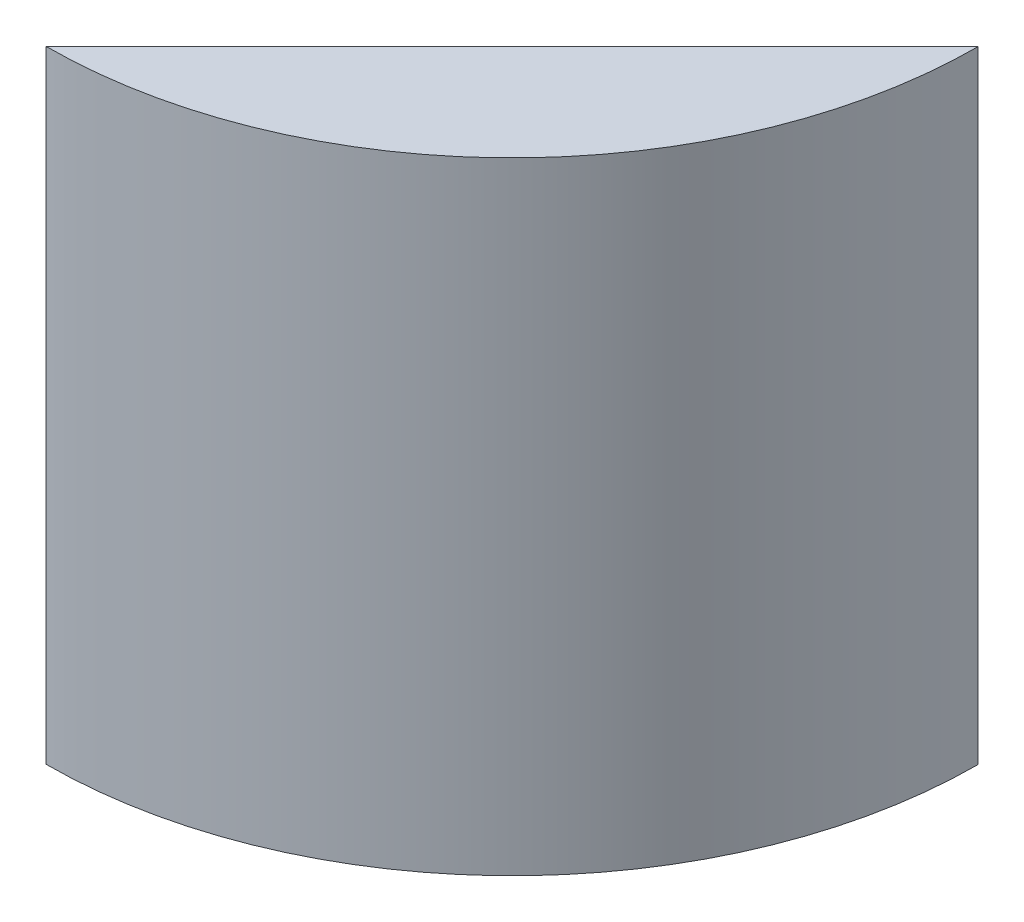
ISO-10303-21;
HEADER;
FILE_DESCRIPTION(('STEP AP214'),'2;1');
FILE_NAME('part.step','',(''),(''),'','','');
FILE_SCHEMA(('AUTOMOTIVE_DESIGN { 1 0 10303 214 1 1 1 1 }'));
ENDSEC;
DATA;
#1=APPLICATION_CONTEXT('core data for automotive mechanical design processes');
#2=APPLICATION_PROTOCOL_DEFINITION('international standard','automotive_design',2000,#1);
#3=PRODUCT_CONTEXT('',#1,'mechanical');
#4=PRODUCT('Part','Part','',(#3));
#5=PRODUCT_RELATED_PRODUCT_CATEGORY('part','',(#4));
#6=PRODUCT_DEFINITION_FORMATION('','',#4);
#7=PRODUCT_DEFINITION_CONTEXT('part definition',#1,'design');
#8=PRODUCT_DEFINITION('design','',#6,#7);
#9=PRODUCT_DEFINITION_SHAPE('','',#8);
#10=(LENGTH_UNIT() NAMED_UNIT(*) SI_UNIT(.MILLI.,.METRE.));
#11=(NAMED_UNIT(*) PLANE_ANGLE_UNIT() SI_UNIT($,.RADIAN.));
#12=(NAMED_UNIT(*) SI_UNIT($,.STERADIAN.) SOLID_ANGLE_UNIT());
#13=UNCERTAINTY_MEASURE_WITH_UNIT(LENGTH_MEASURE(1.E-05),#10,'distance_accuracy_value','');
#14=(GEOMETRIC_REPRESENTATION_CONTEXT(3) GLOBAL_UNCERTAINTY_ASSIGNED_CONTEXT((#13)) GLOBAL_UNIT_ASSIGNED_CONTEXT((#10,
#11,#12)) REPRESENTATION_CONTEXT('',''));
#15=CARTESIAN_POINT('',(0.,0.,0.));
#16=DIRECTION('',(0.,0.,1.));
#17=DIRECTION('',(1.,0.,0.));
#18=AXIS2_PLACEMENT_3D('',#15,#16,#17);
#19=CARTESIAN_POINT('',(0.,114.3,0.));
#20=DIRECTION('',(0.,-1.,0.));
#21=DIRECTION('',(0.,0.,-1.));
#22=AXIS2_PLACEMENT_3D('',#19,#20,#21);
#23=CYLINDRICAL_SURFACE('',#22,85.725);
#24=CARTESIAN_POINT('',(0.,0.,0.));
#25=DIRECTION('',(0.,1.,0.));
#26=DIRECTION('',(0.,0.,1.));
#27=AXIS2_PLACEMENT_3D('',#24,#25,#26);
#28=CIRCLE('',#27,85.725);
#29=CARTESIAN_POINT('',(0.,0.,85.725));
#30=VERTEX_POINT('',#29);
#31=CARTESIAN_POINT('',(85.7249336213076,0.,0.106680000000005));
#32=VERTEX_POINT('',#31);
#33=EDGE_CURVE('E73',#30,#32,#28,.T.);
#34=ORIENTED_EDGE('',*,*,#33,.T.);
#35=DIRECTION('',(0.,1.,0.));
#36=VECTOR('',#35,1.);
#37=CARTESIAN_POINT('',(85.7249336213076,-38.1,0.106680000000005));
#38=LINE('',#37,#36);
#39=CARTESIAN_POINT('',(85.7249336213076,114.3,0.106680000000005));
#40=VERTEX_POINT('',#39);
#41=EDGE_CURVE('E52',#32,#40,#38,.T.);
#42=ORIENTED_EDGE('',*,*,#41,.T.);
#43=CARTESIAN_POINT('',(0.,114.3,0.));
#44=DIRECTION('',(0.,1.,0.));
#45=DIRECTION('',(0.,0.,1.));
#46=AXIS2_PLACEMENT_3D('',#43,#44,#45);
#47=CIRCLE('',#46,85.725);
#48=CARTESIAN_POINT('',(0.,114.3,85.725));
#49=VERTEX_POINT('',#48);
#50=EDGE_CURVE('E45',#49,#40,#47,.T.);
#51=ORIENTED_EDGE('',*,*,#50,.F.);
#52=DIRECTION('',(0.,1.,0.));
#53=VECTOR('',#52,1.);
#54=CARTESIAN_POINT('',(0.,-38.1,85.725));
#55=LINE('',#54,#53);
#56=EDGE_CURVE('E59',#30,#49,#55,.T.);
#57=ORIENTED_EDGE('',*,*,#56,.F.);
#58=EDGE_LOOP('',(#34,#42,#51,#57));
#59=FACE_BOUND('',#58,.T.);
#60=ADVANCED_FACE('F38',(#59),#23,.T.);
#61=CARTESIAN_POINT('',(0.,114.3,0.));
#62=DIRECTION('',(0.,1.,0.));
#63=DIRECTION('',(0.,0.,1.));
#64=AXIS2_PLACEMENT_3D('',#61,#62,#63);
#65=PLANE('',#64);
#66=DIRECTION('',(0.707546621942485,0.,-0.706666666666667));
#67=VECTOR('',#66,1.);
#68=CARTESIAN_POINT('',(85.7249336213076,114.3,0.106680000000005));
#69=LINE('',#68,#67);
#70=EDGE_CURVE('E62',#49,#40,#69,.T.);
#71=ORIENTED_EDGE('',*,*,#70,.F.);
#72=ORIENTED_EDGE('',*,*,#50,.T.);
#73=EDGE_LOOP('',(#71,#72));
#74=FACE_BOUND('',#73,.T.);
#75=ADVANCED_FACE('F70',(#74),#65,.T.);
#76=CARTESIAN_POINT('',(0.,0.,0.));
#77=DIRECTION('',(0.,1.,0.));
#78=DIRECTION('',(0.,0.,1.));
#79=AXIS2_PLACEMENT_3D('',#76,#77,#78);
#80=PLANE('',#79);
#81=CARTESIAN_POINT('',(51.7207334053269,0.,51.7851370830098));
#82=DIRECTION('',(0.,-1.,0.));
#83=DIRECTION('',(0.,0.,-1.));
#84=AXIS2_PLACEMENT_3D('',#81,#82,#83);
#85=CIRCLE('',#84,6.985);
#86=CARTESIAN_POINT('',(51.7207334053269,0.,44.8001370830098));
#87=VERTEX_POINT('',#86);
#88=EDGE_CURVE('E101',#87,#87,#85,.T.);
#89=ORIENTED_EDGE('',*,*,#88,.F.);
#90=EDGE_LOOP('',(#89));
#91=FACE_BOUND('',#90,.T.);
#92=ORIENTED_EDGE('',*,*,#33,.F.);
#93=DIRECTION('',(0.707546621942485,0.,-0.706666666666667));
#94=VECTOR('',#93,1.);
#95=CARTESIAN_POINT('',(42.8624668106538,0.,42.91584));
#96=LINE('',#95,#94);
#97=EDGE_CURVE('E11',#30,#32,#96,.T.);
#98=ORIENTED_EDGE('',*,*,#97,.T.);
#99=EDGE_LOOP('',(#92,#98));
#100=FACE_BOUND('',#99,.T.);
#101=ADVANCED_FACE('F116',(#91,#100),#80,.F.);
#102=CARTESIAN_POINT('',(85.7249336213076,-38.1,0.106680000000005));
#103=DIRECTION('',(0.706666666666667,0.,0.707546621942485));
#104=DIRECTION('',(0.707546621942485,0.,-0.706666666666667));
#105=AXIS2_PLACEMENT_3D('',#102,#103,#104);
#106=PLANE('',#105);
#107=CARTESIAN_POINT('',(53.3759020660972,87.122,32.41548));
#108=DIRECTION('',(-0.706666666666667,0.,-0.707546621942485));
#109=DIRECTION('',(-0.707546621942485,0.,0.706666666666667));
#110=AXIS2_PLACEMENT_3D('',#107,#108,#109);
#111=CIRCLE('',#110,2.77812499999999);
#112=CARTESIAN_POINT('',(51.4102491070133,87.122,34.3786883333333));
#113=VERTEX_POINT('',#112);
#114=EDGE_CURVE('E90',#113,#113,#111,.T.);
#115=ORIENTED_EDGE('',*,*,#114,.F.);
#116=EDGE_LOOP('',(#115));
#117=FACE_BOUND('',#116,.T.);
#118=CARTESIAN_POINT('',(69.5504178437024,29.21,16.26108));
#119=DIRECTION('',(-0.706666666666667,0.,-0.707546621942485));
#120=DIRECTION('',(-0.707546621942485,0.,0.706666666666667));
#121=AXIS2_PLACEMENT_3D('',#118,#119,#120);
#122=CIRCLE('',#121,2.778125);
#123=CARTESIAN_POINT('',(67.5847648846185,29.21,18.2242883333333));
#124=VERTEX_POINT('',#123);
#125=EDGE_CURVE('E83',#124,#124,#122,.T.);
#126=ORIENTED_EDGE('',*,*,#125,.F.);
#127=EDGE_LOOP('',(#126));
#128=FACE_BOUND('',#127,.T.);
#129=CARTESIAN_POINT('',(53.3759020660972,29.21,32.41548));
#130=DIRECTION('',(-0.706666666666667,0.,-0.707546621942485));
#131=DIRECTION('',(-0.707546621942485,0.,0.706666666666667));
#132=AXIS2_PLACEMENT_3D('',#129,#130,#131);
#133=CIRCLE('',#132,2.778125);
#134=CARTESIAN_POINT('',(51.4102491070133,29.21,34.3786883333333));
#135=VERTEX_POINT('',#134);
#136=EDGE_CURVE('E95',#135,#135,#133,.T.);
#137=ORIENTED_EDGE('',*,*,#136,.F.);
#138=EDGE_LOOP('',(#137));
#139=FACE_BOUND('',#138,.T.);
#140=CARTESIAN_POINT('',(69.5504178437024,87.122,16.26108));
#141=DIRECTION('',(-0.706666666666667,0.,-0.707546621942485));
#142=DIRECTION('',(-0.707546621942485,0.,0.706666666666667));
#143=AXIS2_PLACEMENT_3D('',#140,#141,#142);
#144=CIRCLE('',#143,2.778125);
#145=CARTESIAN_POINT('',(67.5847648846185,87.122,18.2242883333333));
#146=VERTEX_POINT('',#145);
#147=EDGE_CURVE('E77',#146,#146,#144,.T.);
#148=ORIENTED_EDGE('',*,*,#147,.F.);
#149=EDGE_LOOP('',(#148));
#150=FACE_BOUND('',#149,.T.);
#151=ORIENTED_EDGE('',*,*,#56,.T.);
#152=ORIENTED_EDGE('',*,*,#70,.T.);
#153=ORIENTED_EDGE('',*,*,#41,.F.);
#154=ORIENTED_EDGE('',*,*,#97,.F.);
#155=EDGE_LOOP('',(#151,#152,#153,#154));
#156=FACE_BOUND('',#155,.T.);
#157=ADVANCED_FACE('F61',(#117,#128,#139,#150,#156),#106,.F.);
#158=CARTESIAN_POINT('',(78.5250845103691,87.122,25.2469220986696));
#159=DIRECTION('',(-0.706666666666667,0.,-0.707546621942485));
#160=DIRECTION('',(-0.707546621942485,0.,0.706666666666667));
#161=AXIS2_PLACEMENT_3D('',#158,#159,#160);
#162=CYLINDRICAL_SURFACE('',#161,2.778125);
#163=CARTESIAN_POINT('',(78.5250845103691,87.122,25.2469220986696));
#164=DIRECTION('',(-0.706666666666667,0.,-0.707546621942485));
#165=DIRECTION('',(-0.707546621942485,0.,0.706666666666667));
#166=AXIS2_PLACEMENT_3D('',#163,#164,#165);
#167=CIRCLE('',#166,2.778125);
#168=CARTESIAN_POINT('',(76.5594315512851,87.122,27.2101304320029));
#169=VERTEX_POINT('',#168);
#170=EDGE_CURVE('E71',#169,#169,#167,.T.);
#171=ORIENTED_EDGE('',*,*,#170,.F.);
#172=EDGE_LOOP('',(#171));
#173=FACE_BOUND('',#172,.T.);
#174=ORIENTED_EDGE('',*,*,#147,.T.);
#175=EDGE_LOOP('',(#174));
#176=FACE_BOUND('',#175,.T.);
#177=ADVANCED_FACE('F123',(#173,#176),#162,.F.);
#178=CARTESIAN_POINT('',(78.5250845103691,87.122,25.2469220986696));
#179=DIRECTION('',(-0.706666666666667,0.,-0.707546621942485));
#180=DIRECTION('',(-0.707546621942485,0.,0.706666666666667));
#181=AXIS2_PLACEMENT_3D('',#178,#179,#180);
#182=PLANE('',#181);
#183=ORIENTED_EDGE('',*,*,#170,.T.);
#184=EDGE_LOOP('',(#183));
#185=FACE_BOUND('',#184,.T.);
#186=ADVANCED_FACE('F150',(#185),#182,.T.);
#187=CARTESIAN_POINT('',(62.3505687327639,29.21,41.4013220986696));
#188=DIRECTION('',(-0.706666666666667,0.,-0.707546621942485));
#189=DIRECTION('',(-0.707546621942485,0.,0.706666666666667));
#190=AXIS2_PLACEMENT_3D('',#187,#188,#189);
#191=CYLINDRICAL_SURFACE('',#190,2.778125);
#192=CARTESIAN_POINT('',(62.3505687327639,29.21,41.4013220986696));
#193=DIRECTION('',(-0.706666666666667,0.,-0.707546621942485));
#194=DIRECTION('',(-0.707546621942485,0.,0.706666666666667));
#195=AXIS2_PLACEMENT_3D('',#192,#193,#194);
#196=CIRCLE('',#195,2.778125);
#197=CARTESIAN_POINT('',(60.3849157736799,29.21,43.3645304320029));
#198=VERTEX_POINT('',#197);
#199=EDGE_CURVE('E87',#198,#198,#196,.T.);
#200=ORIENTED_EDGE('',*,*,#199,.F.);
#201=EDGE_LOOP('',(#200));
#202=FACE_BOUND('',#201,.T.);
#203=ORIENTED_EDGE('',*,*,#136,.T.);
#204=EDGE_LOOP('',(#203));
#205=FACE_BOUND('',#204,.T.);
#206=ADVANCED_FACE('F160',(#202,#205),#191,.F.);
#207=CARTESIAN_POINT('',(62.3505687327639,29.21,41.4013220986696));
#208=DIRECTION('',(-0.706666666666667,0.,-0.707546621942485));
#209=DIRECTION('',(-0.707546621942485,0.,0.706666666666667));
#210=AXIS2_PLACEMENT_3D('',#207,#208,#209);
#211=PLANE('',#210);
#212=ORIENTED_EDGE('',*,*,#199,.T.);
#213=EDGE_LOOP('',(#212));
#214=FACE_BOUND('',#213,.T.);
#215=ADVANCED_FACE('F170',(#214),#211,.T.);
#216=CARTESIAN_POINT('',(78.5250845103691,29.21,25.2469220986696));
#217=DIRECTION('',(-0.706666666666667,0.,-0.707546621942485));
#218=DIRECTION('',(-0.707546621942485,0.,0.706666666666667));
#219=AXIS2_PLACEMENT_3D('',#216,#217,#218);
#220=CYLINDRICAL_SURFACE('',#219,2.778125);
#221=CARTESIAN_POINT('',(78.5250845103691,29.21,25.2469220986696));
#222=DIRECTION('',(-0.706666666666667,0.,-0.707546621942485));
#223=DIRECTION('',(-0.707546621942485,0.,0.706666666666667));
#224=AXIS2_PLACEMENT_3D('',#221,#222,#223);
#225=CIRCLE('',#224,2.778125);
#226=CARTESIAN_POINT('',(76.5594315512851,29.21,27.2101304320029));
#227=VERTEX_POINT('',#226);
#228=EDGE_CURVE('E86',#227,#227,#225,.T.);
#229=ORIENTED_EDGE('',*,*,#228,.F.);
#230=EDGE_LOOP('',(#229));
#231=FACE_BOUND('',#230,.T.);
#232=ORIENTED_EDGE('',*,*,#125,.T.);
#233=EDGE_LOOP('',(#232));
#234=FACE_BOUND('',#233,.T.);
#235=ADVANCED_FACE('F180',(#231,#234),#220,.F.);
#236=CARTESIAN_POINT('',(78.5250845103691,29.21,25.2469220986696));
#237=DIRECTION('',(-0.706666666666667,0.,-0.707546621942485));
#238=DIRECTION('',(-0.707546621942485,0.,0.706666666666667));
#239=AXIS2_PLACEMENT_3D('',#236,#237,#238);
#240=PLANE('',#239);
#241=ORIENTED_EDGE('',*,*,#228,.T.);
#242=EDGE_LOOP('',(#241));
#243=FACE_BOUND('',#242,.T.);
#244=ADVANCED_FACE('F190',(#243),#240,.T.);
#245=CARTESIAN_POINT('',(62.3505687327639,87.122,41.4013220986696));
#246=DIRECTION('',(-0.706666666666667,0.,-0.707546621942485));
#247=DIRECTION('',(-0.707546621942485,0.,0.706666666666667));
#248=AXIS2_PLACEMENT_3D('',#245,#246,#247);
#249=CYLINDRICAL_SURFACE('',#248,2.77812499999999);
#250=CARTESIAN_POINT('',(62.3505687327639,87.122,41.4013220986696));
#251=DIRECTION('',(-0.706666666666667,0.,-0.707546621942485));
#252=DIRECTION('',(-0.707546621942485,0.,0.706666666666667));
#253=AXIS2_PLACEMENT_3D('',#250,#251,#252);
#254=CIRCLE('',#253,2.77812499999999);
#255=CARTESIAN_POINT('',(60.3849157736799,87.122,43.3645304320029));
#256=VERTEX_POINT('',#255);
#257=EDGE_CURVE('E80',#256,#256,#254,.T.);
#258=ORIENTED_EDGE('',*,*,#257,.F.);
#259=EDGE_LOOP('',(#258));
#260=FACE_BOUND('',#259,.T.);
#261=ORIENTED_EDGE('',*,*,#114,.T.);
#262=EDGE_LOOP('',(#261));
#263=FACE_BOUND('',#262,.T.);
#264=ADVANCED_FACE('F200',(#260,#263),#249,.F.);
#265=CARTESIAN_POINT('',(62.3505687327639,87.122,41.4013220986696));
#266=DIRECTION('',(-0.706666666666667,0.,-0.707546621942485));
#267=DIRECTION('',(-0.707546621942485,0.,0.706666666666667));
#268=AXIS2_PLACEMENT_3D('',#265,#266,#267);
#269=PLANE('',#268);
#270=ORIENTED_EDGE('',*,*,#257,.T.);
#271=EDGE_LOOP('',(#270));
#272=FACE_BOUND('',#271,.T.);
#273=ADVANCED_FACE('F112',(#272),#269,.T.);
#274=CARTESIAN_POINT('',(51.7207334053269,6.096,51.7851370830098));
#275=DIRECTION('',(0.,-1.,0.));
#276=DIRECTION('',(0.,0.,-1.));
#277=AXIS2_PLACEMENT_3D('',#274,#275,#276);
#278=CYLINDRICAL_SURFACE('',#277,6.985);
#279=CARTESIAN_POINT('',(51.7207334053269,6.096,51.7851370830098));
#280=DIRECTION('',(0.,-1.,0.));
#281=DIRECTION('',(0.,0.,-1.));
#282=AXIS2_PLACEMENT_3D('',#279,#280,#281);
#283=CIRCLE('',#282,6.985);
#284=CARTESIAN_POINT('',(51.7207334053269,6.096,44.8001370830098));
#285=VERTEX_POINT('',#284);
#286=EDGE_CURVE('E98',#285,#285,#283,.T.);
#287=ORIENTED_EDGE('',*,*,#286,.F.);
#288=EDGE_LOOP('',(#287));
#289=FACE_BOUND('',#288,.T.);
#290=ORIENTED_EDGE('',*,*,#88,.T.);
#291=EDGE_LOOP('',(#290));
#292=FACE_BOUND('',#291,.T.);
#293=ADVANCED_FACE('F109',(#289,#292),#278,.F.);
#294=CARTESIAN_POINT('',(51.7207334053269,6.096,51.7851370830098));
#295=DIRECTION('',(0.,-1.,0.));
#296=DIRECTION('',(0.,0.,-1.));
#297=AXIS2_PLACEMENT_3D('',#294,#295,#296);
#298=PLANE('',#297);
#299=ORIENTED_EDGE('',*,*,#286,.T.);
#300=EDGE_LOOP('',(#299));
#301=FACE_BOUND('',#300,.T.);
#302=ADVANCED_FACE('F107',(#301),#298,.T.);
#303=CLOSED_SHELL('',(#60,#75,#101,#157,#177,#186,#206,#215,#235,#244,#264,#273,#293,#302));
#304=MANIFOLD_SOLID_BREP('B2',#303);
#305=ADVANCED_BREP_SHAPE_REPRESENTATION('',(#18,#304),#14);
#306=SHAPE_DEFINITION_REPRESENTATION(#9,#305);
ENDSEC;
END-ISO-10303-21;
